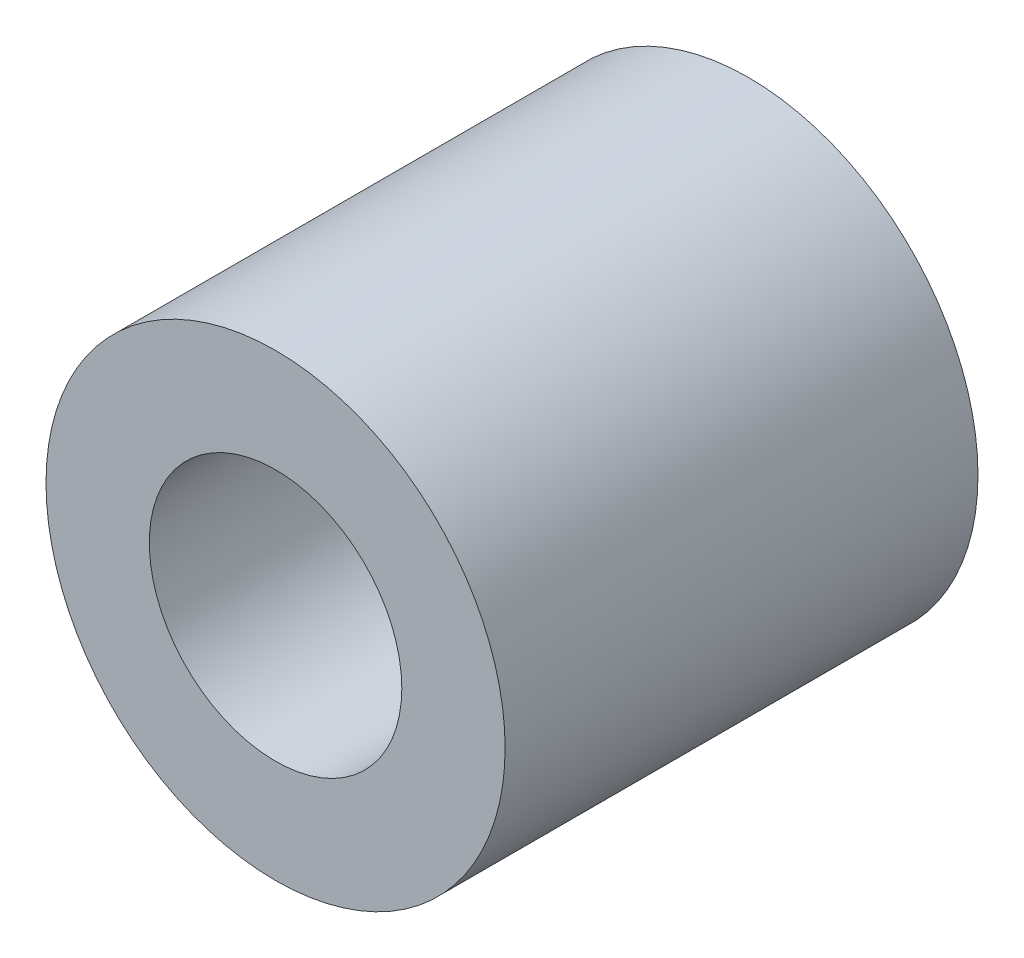
ISO-10303-21;
HEADER;
FILE_DESCRIPTION(('STEP AP214'),'2;1');
FILE_NAME('part.step','',(''),(''),'','','');
FILE_SCHEMA(('AUTOMOTIVE_DESIGN { 1 0 10303 214 1 1 1 1 }'));
ENDSEC;
DATA;
#1=APPLICATION_CONTEXT('core data for automotive mechanical design processes');
#2=APPLICATION_PROTOCOL_DEFINITION('international standard','automotive_design',2000,#1);
#3=PRODUCT_CONTEXT('',#1,'mechanical');
#4=PRODUCT('Part','Part','',(#3));
#5=PRODUCT_RELATED_PRODUCT_CATEGORY('part','',(#4));
#6=PRODUCT_DEFINITION_FORMATION('','',#4);
#7=PRODUCT_DEFINITION_CONTEXT('part definition',#1,'design');
#8=PRODUCT_DEFINITION('design','',#6,#7);
#9=PRODUCT_DEFINITION_SHAPE('','',#8);
#10=(LENGTH_UNIT() NAMED_UNIT(*) SI_UNIT(.MILLI.,.METRE.));
#11=(NAMED_UNIT(*) PLANE_ANGLE_UNIT() SI_UNIT($,.RADIAN.));
#12=(NAMED_UNIT(*) SI_UNIT($,.STERADIAN.) SOLID_ANGLE_UNIT());
#13=UNCERTAINTY_MEASURE_WITH_UNIT(LENGTH_MEASURE(1.E-05),#10,'distance_accuracy_value','');
#14=(GEOMETRIC_REPRESENTATION_CONTEXT(3) GLOBAL_UNCERTAINTY_ASSIGNED_CONTEXT((#13)) GLOBAL_UNIT_ASSIGNED_CONTEXT((#10,
#11,#12)) REPRESENTATION_CONTEXT('',''));
#15=CARTESIAN_POINT('',(0.,0.,0.));
#16=DIRECTION('',(0.,0.,1.));
#17=DIRECTION('',(1.,0.,0.));
#18=AXIS2_PLACEMENT_3D('',#15,#16,#17);
#19=CARTESIAN_POINT('',(0.,0.,4.12));
#20=DIRECTION('',(0.,0.,1.));
#21=DIRECTION('',(1.,0.,0.));
#22=AXIS2_PLACEMENT_3D('',#19,#20,#21);
#23=PLANE('',#22);
#24=CARTESIAN_POINT('',(0.,0.,4.12));
#25=DIRECTION('',(0.,0.,1.));
#26=DIRECTION('',(1.,0.,0.));
#27=AXIS2_PLACEMENT_3D('',#24,#25,#26);
#28=CIRCLE('',#27,2.);
#29=CARTESIAN_POINT('',(2.,0.,4.12));
#30=VERTEX_POINT('',#29);
#31=EDGE_CURVE('E10',#30,#30,#28,.T.);
#32=ORIENTED_EDGE('',*,*,#31,.T.);
#33=EDGE_LOOP('',(#32));
#34=FACE_BOUND('',#33,.T.);
#35=CARTESIAN_POINT('',(0.,0.,4.12));
#36=DIRECTION('',(0.,0.,1.));
#37=DIRECTION('',(1.,0.,0.));
#38=AXIS2_PLACEMENT_3D('',#35,#36,#37);
#39=CIRCLE('',#38,1.1);
#40=CARTESIAN_POINT('',(1.1,0.,4.12));
#41=VERTEX_POINT('',#40);
#42=EDGE_CURVE('E44',#41,#41,#39,.T.);
#43=ORIENTED_EDGE('',*,*,#42,.F.);
#44=EDGE_LOOP('',(#43));
#45=FACE_BOUND('',#44,.T.);
#46=ADVANCED_FACE('F33',(#34,#45),#23,.T.);
#47=CARTESIAN_POINT('',(0.,0.,0.));
#48=DIRECTION('',(0.,0.,1.));
#49=DIRECTION('',(1.,0.,0.));
#50=AXIS2_PLACEMENT_3D('',#47,#48,#49);
#51=PLANE('',#50);
#52=CARTESIAN_POINT('',(0.,0.,0.));
#53=DIRECTION('',(0.,0.,1.));
#54=DIRECTION('',(1.,0.,0.));
#55=AXIS2_PLACEMENT_3D('',#52,#53,#54);
#56=CIRCLE('',#55,2.);
#57=CARTESIAN_POINT('',(2.,0.,0.));
#58=VERTEX_POINT('',#57);
#59=EDGE_CURVE('E37',#58,#58,#56,.T.);
#60=ORIENTED_EDGE('',*,*,#59,.F.);
#61=EDGE_LOOP('',(#60));
#62=FACE_BOUND('',#61,.T.);
#63=CARTESIAN_POINT('',(0.,0.,0.));
#64=DIRECTION('',(0.,0.,1.));
#65=DIRECTION('',(1.,0.,0.));
#66=AXIS2_PLACEMENT_3D('',#63,#64,#65);
#67=CIRCLE('',#66,1.1);
#68=CARTESIAN_POINT('',(1.1,0.,0.));
#69=VERTEX_POINT('',#68);
#70=EDGE_CURVE('E46',#69,#69,#67,.T.);
#71=ORIENTED_EDGE('',*,*,#70,.T.);
#72=EDGE_LOOP('',(#71));
#73=FACE_BOUND('',#72,.T.);
#74=ADVANCED_FACE('F56',(#62,#73),#51,.F.);
#75=CARTESIAN_POINT('',(0.,0.,4.12));
#76=DIRECTION('',(0.,0.,-1.));
#77=DIRECTION('',(-1.,0.,0.));
#78=AXIS2_PLACEMENT_3D('',#75,#76,#77);
#79=CYLINDRICAL_SURFACE('',#78,2.);
#80=ORIENTED_EDGE('',*,*,#31,.F.);
#81=EDGE_LOOP('',(#80));
#82=FACE_BOUND('',#81,.T.);
#83=ORIENTED_EDGE('',*,*,#59,.T.);
#84=EDGE_LOOP('',(#83));
#85=FACE_BOUND('',#84,.T.);
#86=ADVANCED_FACE('F35',(#82,#85),#79,.T.);
#87=CARTESIAN_POINT('',(0.,0.,4.12));
#88=DIRECTION('',(0.,0.,-1.));
#89=DIRECTION('',(-1.,0.,0.));
#90=AXIS2_PLACEMENT_3D('',#87,#88,#89);
#91=CYLINDRICAL_SURFACE('',#90,1.1);
#92=ORIENTED_EDGE('',*,*,#42,.T.);
#93=EDGE_LOOP('',(#92));
#94=FACE_BOUND('',#93,.T.);
#95=ORIENTED_EDGE('',*,*,#70,.F.);
#96=EDGE_LOOP('',(#95));
#97=FACE_BOUND('',#96,.T.);
#98=ADVANCED_FACE('F52',(#94,#97),#91,.F.);
#99=CLOSED_SHELL('',(#46,#74,#86,#98));
#100=MANIFOLD_SOLID_BREP('B2',#99);
#101=ADVANCED_BREP_SHAPE_REPRESENTATION('',(#18,#100),#14);
#102=SHAPE_DEFINITION_REPRESENTATION(#9,#101);
ENDSEC;
END-ISO-10303-21;
